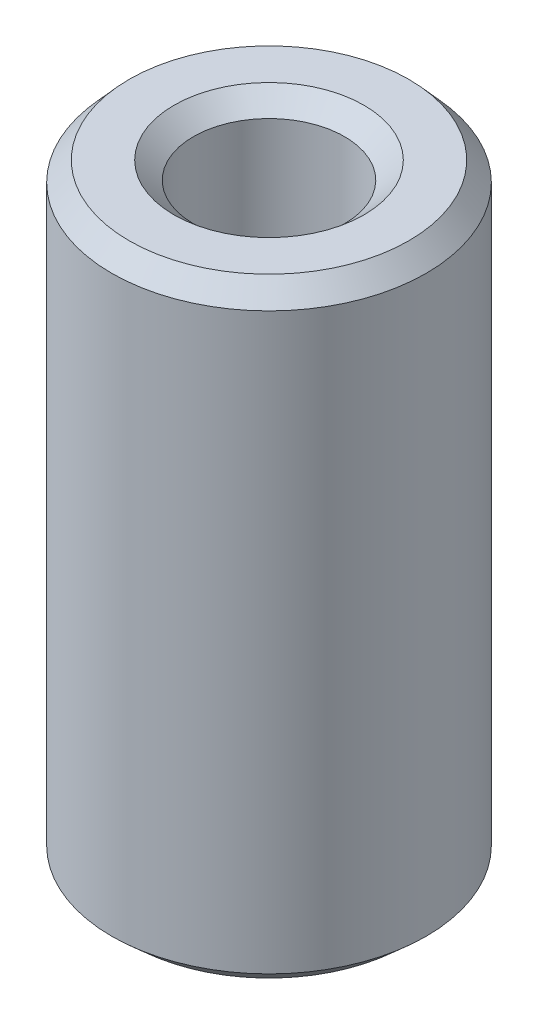
ISO-10303-21;
HEADER;
FILE_DESCRIPTION(('STEP AP214'),'2;1');
FILE_NAME('part.step','',(''),(''),'','','');
FILE_SCHEMA(('AUTOMOTIVE_DESIGN { 1 0 10303 214 1 1 1 1 }'));
ENDSEC;
DATA;
#1=APPLICATION_CONTEXT('core data for automotive mechanical design processes');
#2=APPLICATION_PROTOCOL_DEFINITION('international standard','automotive_design',2000,#1);
#3=PRODUCT_CONTEXT('',#1,'mechanical');
#4=PRODUCT('Part','Part','',(#3));
#5=PRODUCT_RELATED_PRODUCT_CATEGORY('part','',(#4));
#6=PRODUCT_DEFINITION_FORMATION('','',#4);
#7=PRODUCT_DEFINITION_CONTEXT('part definition',#1,'design');
#8=PRODUCT_DEFINITION('design','',#6,#7);
#9=PRODUCT_DEFINITION_SHAPE('','',#8);
#10=(LENGTH_UNIT() NAMED_UNIT(*) SI_UNIT(.MILLI.,.METRE.));
#11=(NAMED_UNIT(*) PLANE_ANGLE_UNIT() SI_UNIT($,.RADIAN.));
#12=(NAMED_UNIT(*) SI_UNIT($,.STERADIAN.) SOLID_ANGLE_UNIT());
#13=UNCERTAINTY_MEASURE_WITH_UNIT(LENGTH_MEASURE(1.E-05),#10,'distance_accuracy_value','');
#14=(GEOMETRIC_REPRESENTATION_CONTEXT(3) GLOBAL_UNCERTAINTY_ASSIGNED_CONTEXT((#13)) GLOBAL_UNIT_ASSIGNED_CONTEXT((#10,
#11,#12)) REPRESENTATION_CONTEXT('',''));
#15=CARTESIAN_POINT('',(0.,0.,0.));
#16=DIRECTION('',(0.,0.,1.));
#17=DIRECTION('',(1.,0.,0.));
#18=AXIS2_PLACEMENT_3D('',#15,#16,#17);
#19=CARTESIAN_POINT('',(0.,58.2926853875397,0.));
#20=DIRECTION('',(0.,-1.,0.));
#21=DIRECTION('',(0.,0.,-1.));
#22=AXIS2_PLACEMENT_3D('',#19,#20,#21);
#23=CYLINDRICAL_SURFACE('',#22,15.);
#24=CARTESIAN_POINT('',(0.,1.66068706225825,0.));
#25=DIRECTION('',(0.,1.,0.));
#26=DIRECTION('',(0.,0.,1.));
#27=AXIS2_PLACEMENT_3D('',#24,#25,#26);
#28=CIRCLE('',#27,15.);
#29=CARTESIAN_POINT('',(0.,1.66068706225825,-15.));
#30=VERTEX_POINT('',#29);
#31=EDGE_CURVE('E10',#30,#30,#28,.T.);
#32=CARTESIAN_POINT('',(0.,56.4344676450379,0.));
#33=DIRECTION('',(0.,1.,0.));
#34=DIRECTION('',(0.,0.,1.));
#35=AXIS2_PLACEMENT_3D('',#32,#33,#34);
#36=CIRCLE('',#35,15.);
#37=CARTESIAN_POINT('',(0.,56.4344676450379,-15.));
#38=VERTEX_POINT('',#37);
#39=EDGE_CURVE('E50',#38,#38,#36,.F.);
#40=CARTESIAN_POINT('',(0.,1.66068706225825,-15.));
#41=CARTESIAN_POINT('',(0.,2.2312472766622,-15.));
#42=CARTESIAN_POINT('',(0.,2.80180749106616,-15.));
#43=CARTESIAN_POINT('',(0.,3.94292791987407,-15.));
#44=CARTESIAN_POINT('',(0.,4.51348813427802,-15.));
#45=CARTESIAN_POINT('',(0.,5.65460856308593,-15.));
#46=CARTESIAN_POINT('',(0.,6.22516877748989,-15.));
#47=CARTESIAN_POINT('',(0.,7.3662892062978,-15.));
#48=CARTESIAN_POINT('',(0.,7.93684942070175,-15.));
#49=CARTESIAN_POINT('',(0.,9.07796984950966,-15.));
#50=CARTESIAN_POINT('',(0.,9.64853006391361,-15.));
#51=CARTESIAN_POINT('',(0.,10.7896504927215,-15.));
#52=CARTESIAN_POINT('',(0.,11.3602107071255,-15.));
#53=CARTESIAN_POINT('',(0.,12.5013311359334,-15.));
#54=CARTESIAN_POINT('',(0.,13.0718913503373,-15.));
#55=CARTESIAN_POINT('',(0.,14.2130117791453,-15.));
#56=CARTESIAN_POINT('',(0.,14.7835719935492,-15.));
#57=CARTESIAN_POINT('',(0.,15.9246924223571,-15.));
#58=CARTESIAN_POINT('',(0.,16.4952526367611,-15.));
#59=CARTESIAN_POINT('',(0.,17.636373065569,-15.));
#60=CARTESIAN_POINT('',(0.,18.2069332799729,-15.));
#61=CARTESIAN_POINT('',(0.,19.3480537087808,-15.));
#62=CARTESIAN_POINT('',(0.,19.9186139231848,-15.));
#63=CARTESIAN_POINT('',(0.,21.0597343519927,-15.));
#64=CARTESIAN_POINT('',(0.,21.6302945663967,-15.));
#65=CARTESIAN_POINT('',(0.,22.7714149952046,-15.));
#66=CARTESIAN_POINT('',(0.,23.3419752096085,-15.));
#67=CARTESIAN_POINT('',(0.,24.4830956384164,-15.));
#68=CARTESIAN_POINT('',(0.,25.0536558528204,-15.));
#69=CARTESIAN_POINT('',(0.,26.1947762816283,-15.));
#70=CARTESIAN_POINT('',(0.,26.7653364960323,-15.));
#71=CARTESIAN_POINT('',(0.,27.9064569248402,-15.));
#72=CARTESIAN_POINT('',(0.,28.4770171392441,-15.));
#73=CARTESIAN_POINT('',(0.,29.618137568052,-15.));
#74=CARTESIAN_POINT('',(0.,30.188697782456,-15.));
#75=CARTESIAN_POINT('',(0.,31.3298182112639,-15.));
#76=CARTESIAN_POINT('',(0.,31.9003784256679,-15.));
#77=CARTESIAN_POINT('',(0.,33.0414988544758,-15.));
#78=CARTESIAN_POINT('',(0.,33.6120590688797,-15.));
#79=CARTESIAN_POINT('',(0.,34.7531794976876,-15.));
#80=CARTESIAN_POINT('',(0.,35.3237397120916,-15.));
#81=CARTESIAN_POINT('',(0.,36.4648601408995,-15.));
#82=CARTESIAN_POINT('',(0.,37.0354203553034,-15.));
#83=CARTESIAN_POINT('',(0.,38.1765407841114,-15.));
#84=CARTESIAN_POINT('',(0.,38.7471009985153,-15.));
#85=CARTESIAN_POINT('',(0.,39.8882214273232,-15.));
#86=CARTESIAN_POINT('',(0.,40.4587816417272,-15.));
#87=CARTESIAN_POINT('',(0.,41.5999020705351,-15.));
#88=CARTESIAN_POINT('',(0.,42.170462284939,-15.));
#89=CARTESIAN_POINT('',(0.,43.311582713747,-15.));
#90=CARTESIAN_POINT('',(0.,43.8821429281509,-15.));
#91=CARTESIAN_POINT('',(0.,45.0232633569588,-15.));
#92=CARTESIAN_POINT('',(0.,45.5938235713628,-15.));
#93=CARTESIAN_POINT('',(0.,46.7349440001707,-15.));
#94=CARTESIAN_POINT('',(0.,47.3055042145746,-15.));
#95=CARTESIAN_POINT('',(0.,48.4466246433825,-15.));
#96=CARTESIAN_POINT('',(0.,49.0171848577865,-15.));
#97=CARTESIAN_POINT('',(0.,50.1583052865944,-15.));
#98=CARTESIAN_POINT('',(0.,50.7288655009984,-15.));
#99=CARTESIAN_POINT('',(0.,51.8699859298063,-15.));
#100=CARTESIAN_POINT('',(0.,52.4405461442102,-15.));
#101=CARTESIAN_POINT('',(0.,53.5816665730181,-15.));
#102=CARTESIAN_POINT('',(0.,54.1522267874221,-15.));
#103=CARTESIAN_POINT('',(0.,55.29334721623,-15.));
#104=CARTESIAN_POINT('',(0.,55.863907430634,-15.));
#105=CARTESIAN_POINT('',(0.,56.4344676450379,-15.));
#106=B_SPLINE_CURVE_WITH_KNOTS('',3,(#40,#41,#42,#43,#44,#45,#46,#47,#48,#49,#50,#51,#52,#53,
#54,#55,#56,#57,#58,#59,#60,#61,#62,#63,#64,#65,#66,#67,#68,#69,#70,#71,#72,#73,#74,#75,#76,#77,
#78,#79,#80,#81,#82,#83,#84,#85,#86,#87,#88,#89,#90,#91,#92,#93,#94,#95,#96,#97,#98,#99,#100,
#101,#102,#103,#104,#105),.UNSPECIFIED.,.F.,.F.,(4,2,2,2,2,2,2,2,2,2,2,2,2,2,2,2,2,2,2,2,2,2,2,
2,2,2,2,2,2,2,2,2,4),(0.,1.71168064321187,3.42336128642373,5.1350419296356,6.84672257284746,
8.55840321605932,10.2700838592712,11.9817645024831,13.6934451456949,15.4051257889068,
17.1168064321186,18.8284870753305,20.5401677185424,22.2518483617542,23.9635290049661,
25.675209648178,27.3868902913898,29.0985709346017,30.8102515778136,32.5219322210254,
34.2336128642373,35.9452935074492,37.656974150661,39.3686547938729,41.0803354370848,
42.7920160802966,44.5036967235085,46.2153773667203,47.9270580099322,49.6387386531441,
51.3504192963559,53.0620999395678,54.7737805827797),.UNSPECIFIED.);
#107=EDGE_CURVE('BSEAM39',#30,#38,#106,.T.);
#108=ORIENTED_EDGE('',*,*,#31,.T.);
#109=ORIENTED_EDGE('',*,*,#39,.T.);
#110=ORIENTED_EDGE('',*,*,#107,.T.);
#111=ORIENTED_EDGE('',*,*,#107,.F.);
#112=EDGE_LOOP('',(#108,#110,#109,#111));
#113=FACE_BOUND('',#112,.T.);
#114=ADVANCED_FACE('F39',(#113),#23,.T.);
#115=CARTESIAN_POINT('',(0.,58.2926853875397,0.));
#116=DIRECTION('',(0.,1.,0.));
#117=DIRECTION('',(0.,0.,1.));
#118=AXIS2_PLACEMENT_3D('',#115,#116,#117);
#119=PLANE('',#118);
#120=CARTESIAN_POINT('',(0.,58.2926853875397,0.));
#121=DIRECTION('',(0.,1.,0.));
#122=DIRECTION('',(0.,0.,1.));
#123=AXIS2_PLACEMENT_3D('',#120,#121,#122);
#124=CIRCLE('',#123,9.06258354995385);
#125=CARTESIAN_POINT('',(0.,58.2926853875397,9.06258354995385));
#126=VERTEX_POINT('',#125);
#127=EDGE_CURVE('E58',#126,#126,#124,.F.);
#128=ORIENTED_EDGE('',*,*,#127,.T.);
#129=EDGE_LOOP('',(#128));
#130=FACE_BOUND('',#129,.T.);
#131=CARTESIAN_POINT('',(0.,58.2926853875397,0.));
#132=DIRECTION('',(0.,1.,0.));
#133=DIRECTION('',(0.,0.,1.));
#134=AXIS2_PLACEMENT_3D('',#131,#132,#133);
#135=CIRCLE('',#134,13.3393129377417);
#136=CARTESIAN_POINT('',(0.,58.2926853875397,-13.3393129377417));
#137=VERTEX_POINT('',#136);
#138=EDGE_CURVE('E61',#137,#137,#135,.T.);
#139=ORIENTED_EDGE('',*,*,#138,.T.);
#140=EDGE_LOOP('',(#139));
#141=FACE_BOUND('',#140,.T.);
#142=ADVANCED_FACE('F88',(#130,#141),#119,.T.);
#143=CARTESIAN_POINT('',(0.,0.,0.));
#144=DIRECTION('',(0.,1.,0.));
#145=DIRECTION('',(0.,0.,1.));
#146=AXIS2_PLACEMENT_3D('',#143,#144,#145);
#147=PLANE('',#146);
#148=CARTESIAN_POINT('',(0.,0.,0.));
#149=DIRECTION('',(0.,1.,0.));
#150=DIRECTION('',(0.,0.,1.));
#151=AXIS2_PLACEMENT_3D('',#148,#149,#150);
#152=CIRCLE('',#151,8.8650528697103);
#153=CARTESIAN_POINT('',(0.,0.,8.8650528697103));
#154=VERTEX_POINT('',#153);
#155=EDGE_CURVE('E51',#154,#154,#152,.T.);
#156=ORIENTED_EDGE('',*,*,#155,.T.);
#157=EDGE_LOOP('',(#156));
#158=FACE_BOUND('',#157,.T.);
#159=CARTESIAN_POINT('',(0.,0.,0.));
#160=DIRECTION('',(0.,1.,0.));
#161=DIRECTION('',(0.,0.,1.));
#162=AXIS2_PLACEMENT_3D('',#159,#160,#161);
#163=CIRCLE('',#162,13.1417822574982);
#164=CARTESIAN_POINT('',(0.,0.,13.1417822574982));
#165=VERTEX_POINT('',#164);
#166=EDGE_CURVE('E54',#165,#165,#163,.F.);
#167=ORIENTED_EDGE('',*,*,#166,.T.);
#168=EDGE_LOOP('',(#167));
#169=FACE_BOUND('',#168,.T.);
#170=ADVANCED_FACE('F83',(#158,#169),#147,.F.);
#171=CARTESIAN_POINT('',(0.,58.2926853875397,0.));
#172=DIRECTION('',(0.,-1.,0.));
#173=DIRECTION('',(0.,0.,-1.));
#174=AXIS2_PLACEMENT_3D('',#171,#172,#173);
#175=CYLINDRICAL_SURFACE('',#174,7.20436580745205);
#176=CARTESIAN_POINT('',(0.,56.6319983252814,0.));
#177=DIRECTION('',(0.,1.,0.));
#178=DIRECTION('',(0.,0.,1.));
#179=AXIS2_PLACEMENT_3D('',#176,#177,#178);
#180=CIRCLE('',#179,7.20436580745205);
#181=CARTESIAN_POINT('',(0.,56.6319983252814,7.20436580745205));
#182=VERTEX_POINT('',#181);
#183=EDGE_CURVE('E67',#182,#182,#180,.T.);
#184=ORIENTED_EDGE('',*,*,#183,.T.);
#185=EDGE_LOOP('',(#184));
#186=FACE_BOUND('',#185,.T.);
#187=CARTESIAN_POINT('',(0.,1.85821774250177,0.));
#188=DIRECTION('',(0.,1.,0.));
#189=DIRECTION('',(0.,0.,1.));
#190=AXIS2_PLACEMENT_3D('',#187,#188,#189);
#191=CIRCLE('',#190,7.20436580745205);
#192=CARTESIAN_POINT('',(0.,1.85821774250177,7.20436580745205));
#193=VERTEX_POINT('',#192);
#194=EDGE_CURVE('E69',#193,#193,#191,.F.);
#195=ORIENTED_EDGE('',*,*,#194,.T.);
#196=EDGE_LOOP('',(#195));
#197=FACE_BOUND('',#196,.T.);
#198=ADVANCED_FACE('F71',(#186,#197),#175,.F.);
#199=CARTESIAN_POINT('',(0.,56.6319983252814,0.));
#200=DIRECTION('',(0.,1.,0.));
#201=DIRECTION('',(0.,0.,1.));
#202=AXIS2_PLACEMENT_3D('',#199,#200,#201);
#203=CONICAL_SURFACE('',#202,7.20436580745205,0.841473450112755);
#204=ORIENTED_EDGE('',*,*,#127,.F.);
#205=EDGE_LOOP('',(#204));
#206=FACE_BOUND('',#205,.T.);
#207=ORIENTED_EDGE('',*,*,#183,.F.);
#208=EDGE_LOOP('',(#207));
#209=FACE_BOUND('',#208,.T.);
#210=ADVANCED_FACE('F77',(#206,#209),#203,.F.);
#211=CARTESIAN_POINT('',(0.,0.,0.));
#212=DIRECTION('',(0.,-1.,0.));
#213=DIRECTION('',(0.,0.,-1.));
#214=AXIS2_PLACEMENT_3D('',#211,#212,#213);
#215=CONICAL_SURFACE('',#214,8.8650528697103,0.729322876682143);
#216=ORIENTED_EDGE('',*,*,#194,.F.);
#217=EDGE_LOOP('',(#216));
#218=FACE_BOUND('',#217,.T.);
#219=ORIENTED_EDGE('',*,*,#155,.F.);
#220=EDGE_LOOP('',(#219));
#221=FACE_BOUND('',#220,.T.);
#222=ADVANCED_FACE('F73',(#218,#221),#215,.F.);
#223=CARTESIAN_POINT('',(0.,1.66068706225825,0.));
#224=DIRECTION('',(0.,1.,0.));
#225=DIRECTION('',(0.,0.,1.));
#226=AXIS2_PLACEMENT_3D('',#223,#224,#225);
#227=CONICAL_SURFACE('',#226,15.,0.841473450112755);
#228=ORIENTED_EDGE('',*,*,#166,.F.);
#229=EDGE_LOOP('',(#228));
#230=FACE_BOUND('',#229,.T.);
#231=ORIENTED_EDGE('',*,*,#31,.F.);
#232=EDGE_LOOP('',(#231));
#233=FACE_BOUND('',#232,.T.);
#234=ADVANCED_FACE('F76',(#230,#233),#227,.T.);
#235=CARTESIAN_POINT('',(0.,58.2926853875397,0.));
#236=DIRECTION('',(0.,-1.,0.));
#237=DIRECTION('',(0.,0.,-1.));
#238=AXIS2_PLACEMENT_3D('',#235,#236,#237);
#239=CONICAL_SURFACE('',#238,13.3393129377417,0.729322876682142);
#240=CARTESIAN_POINT('',(0.,56.4344676450379,-15.));
#241=CARTESIAN_POINT('',(0.,56.4538240798556,-14.9827011764348));
#242=CARTESIAN_POINT('',(0.,56.4731805146734,-14.9654023528696));
#243=CARTESIAN_POINT('',(0.,56.5118933843088,-14.9308047057392));
#244=CARTESIAN_POINT('',(0.,56.5312498191265,-14.9135058821741));
#245=CARTESIAN_POINT('',(0.,56.569962688762,-14.8789082350437));
#246=CARTESIAN_POINT('',(0.,56.5893191235797,-14.8616094114785));
#247=CARTESIAN_POINT('',(0.,56.6280319932152,-14.8270117643481));
#248=CARTESIAN_POINT('',(0.,56.6473884280329,-14.8097129407829));
#249=CARTESIAN_POINT('',(0.,56.6861012976684,-14.7751152936525));
#250=CARTESIAN_POINT('',(0.,56.7054577324861,-14.7578164700873));
#251=CARTESIAN_POINT('',(0.,56.7441706021215,-14.723218822957));
#252=CARTESIAN_POINT('',(0.,56.7635270369393,-14.7059199993918));
#253=CARTESIAN_POINT('',(0.,56.8022399065747,-14.6713223522614));
#254=CARTESIAN_POINT('',(0.,56.8215963413924,-14.6540235286962));
#255=CARTESIAN_POINT('',(0.,56.8603092110279,-14.6194258815658));
#256=CARTESIAN_POINT('',(0.,56.8796656458456,-14.6021270580006));
#257=CARTESIAN_POINT('',(0.,56.9183785154811,-14.5675294108702));
#258=CARTESIAN_POINT('',(0.,56.9377349502988,-14.5502305873051));
#259=CARTESIAN_POINT('',(0.,56.9764478199343,-14.5156329401747));
#260=CARTESIAN_POINT('',(0.,56.995804254752,-14.4983341166095));
#261=CARTESIAN_POINT('',(0.,57.0345171243874,-14.4637364694791));
#262=CARTESIAN_POINT('',(0.,57.0538735592052,-14.4464376459139));
#263=CARTESIAN_POINT('',(0.,57.0925864288406,-14.4118399987835));
#264=CARTESIAN_POINT('',(0.,57.1119428636583,-14.3945411752183));
#265=CARTESIAN_POINT('',(0.,57.1506557332938,-14.359943528088));
#266=CARTESIAN_POINT('',(0.,57.1700121681115,-14.3426447045228));
#267=CARTESIAN_POINT('',(0.,57.208725037747,-14.3080470573924));
#268=CARTESIAN_POINT('',(0.,57.2280814725647,-14.2907482338272));
#269=CARTESIAN_POINT('',(0.,57.2667943422002,-14.2561505866968));
#270=CARTESIAN_POINT('',(0.,57.2861507770179,-14.2388517631316));
#271=CARTESIAN_POINT('',(0.,57.3248636466533,-14.2042541160013));
#272=CARTESIAN_POINT('',(0.,57.3442200814711,-14.1869552924361));
#273=CARTESIAN_POINT('',(0.,57.3829329511065,-14.1523576453057));
#274=CARTESIAN_POINT('',(0.,57.4022893859243,-14.1350588217405));
#275=CARTESIAN_POINT('',(0.,57.4410022555597,-14.1004611746101));
#276=CARTESIAN_POINT('',(0.,57.4603586903774,-14.0831623510449));
#277=CARTESIAN_POINT('',(0.,57.4990715600129,-14.0485647039145));
#278=CARTESIAN_POINT('',(0.,57.5184279948306,-14.0312658803494));
#279=CARTESIAN_POINT('',(0.,57.5571408644661,-13.996668233219));
#280=CARTESIAN_POINT('',(0.,57.5764972992838,-13.9793694096538));
#281=CARTESIAN_POINT('',(0.,57.6152101689192,-13.9447717625234));
#282=CARTESIAN_POINT('',(0.,57.634566603737,-13.9274729389582));
#283=CARTESIAN_POINT('',(0.,57.6732794733724,-13.8928752918278));
#284=CARTESIAN_POINT('',(0.,57.6926359081902,-13.8755764682626));
#285=CARTESIAN_POINT('',(0.,57.7313487778256,-13.8409788211323));
#286=CARTESIAN_POINT('',(0.,57.7507052126433,-13.8236799975671));
#287=CARTESIAN_POINT('',(0.,57.7894180822788,-13.7890823504367));
#288=CARTESIAN_POINT('',(0.,57.8087745170965,-13.7717835268715));
#289=CARTESIAN_POINT('',(0.,57.847487386732,-13.7371858797411));
#290=CARTESIAN_POINT('',(0.,57.8668438215497,-13.7198870561759));
#291=CARTESIAN_POINT('',(0.,57.9055566911852,-13.6852894090456));
#292=CARTESIAN_POINT('',(0.,57.9249131260029,-13.6679905854804));
#293=CARTESIAN_POINT('',(0.,57.9636259956383,-13.63339293835));
#294=CARTESIAN_POINT('',(0.,57.9829824304561,-13.6160941147848));
#295=CARTESIAN_POINT('',(0.,58.0216953000915,-13.5814964676544));
#296=CARTESIAN_POINT('',(0.,58.0410517349092,-13.5641976440892));
#297=CARTESIAN_POINT('',(0.,58.0797646045447,-13.5295999969588));
#298=CARTESIAN_POINT('',(0.,58.0991210393624,-13.5123011733936));
#299=CARTESIAN_POINT('',(0.,58.1378339089979,-13.4777035262633));
#300=CARTESIAN_POINT('',(0.,58.1571903438156,-13.4604047026981));
#301=CARTESIAN_POINT('',(0.,58.1959032134511,-13.4258070555677));
#302=CARTESIAN_POINT('',(0.,58.2152596482688,-13.4085082320025));
#303=CARTESIAN_POINT('',(0.,58.2539725179042,-13.3739105848721));
#304=CARTESIAN_POINT('',(0.,58.273328952722,-13.3566117613069));
#305=CARTESIAN_POINT('',(0.,58.2926853875397,-13.3393129377417));
#306=B_SPLINE_CURVE_WITH_KNOTS('',3,(#240,#241,#242,#243,#244,#245,#246,#247,#248,#249,#250,
#251,#252,#253,#254,#255,#256,#257,#258,#259,#260,#261,#262,#263,#264,#265,#266,#267,#268,#269,
#270,#271,#272,#273,#274,#275,#276,#277,#278,#279,#280,#281,#282,#283,#284,#285,#286,#287,#288,
#289,#290,#291,#292,#293,#294,#295,#296,#297,#298,#299,#300,#301,#302,#303,#304,#305),
.UNSPECIFIED.,.F.,.F.,(4,2,2,2,2,2,2,2,2,2,2,2,2,2,2,2,2,2,2,2,2,2,2,2,2,2,2,2,2,2,2,2,4),(0.,
0.0778799575650434,0.155759915130082,0.23363987269512,0.311519830260158,0.389399787825203,
0.467279745390241,0.545159702955279,0.623039660520317,0.700919618085361,0.778799575650399,
0.856679533215437,0.934559490780477,1.01243944834552,1.09031940591056,1.1681993634756,
1.24607932104063,1.32395927860568,1.40183923617072,1.47971919373576,1.55759915130079,
1.63547910886584,1.71335906643088,1.79123902399591,1.86911898156096,1.946998939126,
2.02487889669103,2.10275885425607,2.18063881182112,2.25851876938615,2.33639872695119,
2.41427868451623,2.49215864208127),.UNSPECIFIED.);
#307=EDGE_CURVE('BSEAM45',#38,#137,#306,.T.);
#308=ORIENTED_EDGE('',*,*,#39,.F.);
#309=ORIENTED_EDGE('',*,*,#138,.F.);
#310=ORIENTED_EDGE('',*,*,#307,.T.);
#311=ORIENTED_EDGE('',*,*,#307,.F.);
#312=EDGE_LOOP('',(#308,#310,#309,#311));
#313=FACE_BOUND('',#312,.T.);
#314=ADVANCED_FACE('F45',(#313),#239,.T.);
#315=CLOSED_SHELL('',(#114,#142,#170,#198,#210,#222,#234,#314));
#316=MANIFOLD_SOLID_BREP('B2',#315);
#317=ADVANCED_BREP_SHAPE_REPRESENTATION('',(#18,#316),#14);
#318=SHAPE_DEFINITION_REPRESENTATION(#9,#317);
ENDSEC;
END-ISO-10303-21;
